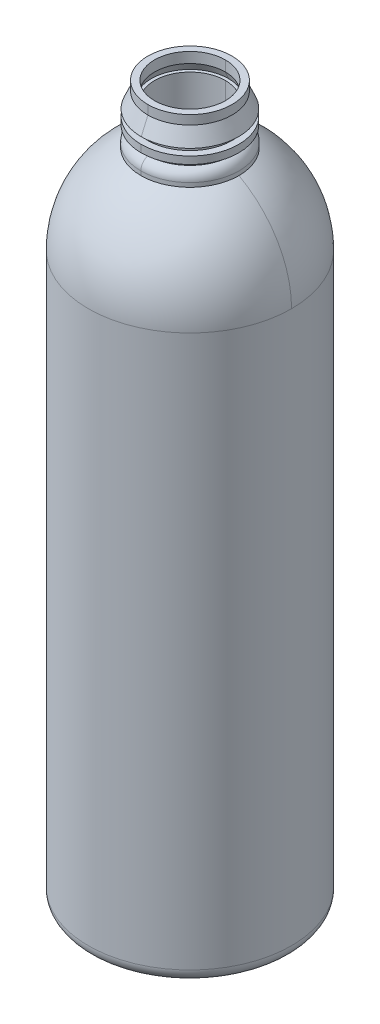
ISO-10303-21;
HEADER;
FILE_DESCRIPTION(('STEP AP214'),'2;1');
FILE_NAME('part.step','',(''),(''),'','','');
FILE_SCHEMA(('AUTOMOTIVE_DESIGN { 1 0 10303 214 1 1 1 1 }'));
ENDSEC;
DATA;
#1=APPLICATION_CONTEXT('core data for automotive mechanical design processes');
#2=APPLICATION_PROTOCOL_DEFINITION('international standard','automotive_design',2000,#1);
#3=PRODUCT_CONTEXT('',#1,'mechanical');
#4=PRODUCT('Part','Part','',(#3));
#5=PRODUCT_RELATED_PRODUCT_CATEGORY('part','',(#4));
#6=PRODUCT_DEFINITION_FORMATION('','',#4);
#7=PRODUCT_DEFINITION_CONTEXT('part definition',#1,'design');
#8=PRODUCT_DEFINITION('design','',#6,#7);
#9=PRODUCT_DEFINITION_SHAPE('','',#8);
#10=(LENGTH_UNIT() NAMED_UNIT(*) SI_UNIT(.MILLI.,.METRE.));
#11=(NAMED_UNIT(*) PLANE_ANGLE_UNIT() SI_UNIT($,.RADIAN.));
#12=(NAMED_UNIT(*) SI_UNIT($,.STERADIAN.) SOLID_ANGLE_UNIT());
#13=UNCERTAINTY_MEASURE_WITH_UNIT(LENGTH_MEASURE(1.E-05),#10,'distance_accuracy_value','');
#14=(GEOMETRIC_REPRESENTATION_CONTEXT(3) GLOBAL_UNCERTAINTY_ASSIGNED_CONTEXT((#13)) GLOBAL_UNIT_ASSIGNED_CONTEXT((#10,
#11,#12)) REPRESENTATION_CONTEXT('',''));
#15=CARTESIAN_POINT('',(0.,0.,0.));
#16=DIRECTION('',(0.,0.,1.));
#17=DIRECTION('',(1.,0.,0.));
#18=AXIS2_PLACEMENT_3D('',#15,#16,#17);
#19=CARTESIAN_POINT('',(0.,99.5234291293078,0.));
#20=DIRECTION('',(0.,1.,0.));
#21=DIRECTION('',(0.,0.,1.));
#22=AXIS2_PLACEMENT_3D('',#19,#20,#21);
#23=CYLINDRICAL_SURFACE('',#22,27.1);
#24=CARTESIAN_POINT('',(0.,-70.5483925549915,0.));
#25=DIRECTION('',(0.,-1.,0.));
#26=DIRECTION('',(0.,0.,-1.));
#27=AXIS2_PLACEMENT_3D('',#24,#25,#26);
#28=CIRCLE('',#27,27.1);
#29=CARTESIAN_POINT('',(0.,-70.5483925549915,-27.1));
#30=VERTEX_POINT('',#29);
#31=CARTESIAN_POINT('',(0.,-70.5483925549915,27.1));
#32=VERTEX_POINT('',#31);
#33=EDGE_CURVE('E281',#30,#32,#28,.F.);
#34=ORIENTED_EDGE('',*,*,#33,.F.);
#35=DIRECTION('',(0.,1.,0.));
#36=VECTOR('',#35,1.);
#37=CARTESIAN_POINT('',(0.,99.5234291293078,-27.1));
#38=LINE('',#37,#36);
#39=CARTESIAN_POINT('',(0.,64.,-27.1));
#40=VERTEX_POINT('',#39);
#41=EDGE_CURVE('E267',#30,#40,#38,.T.);
#42=ORIENTED_EDGE('',*,*,#41,.T.);
#43=CARTESIAN_POINT('',(0.,64.,0.));
#44=DIRECTION('',(0.,1.,0.));
#45=DIRECTION('',(0.,0.,1.));
#46=AXIS2_PLACEMENT_3D('',#43,#44,#45);
#47=CIRCLE('',#46,27.1);
#48=CARTESIAN_POINT('',(-27.1,64.,0.));
#49=VERTEX_POINT('',#48);
#50=EDGE_CURVE('E278',#40,#49,#47,.T.);
#51=ORIENTED_EDGE('',*,*,#50,.T.);
#52=CARTESIAN_POINT('',(0.,64.,0.));
#53=DIRECTION('',(0.,1.,0.));
#54=DIRECTION('',(0.,0.,1.));
#55=AXIS2_PLACEMENT_3D('',#52,#53,#54);
#56=CIRCLE('',#55,27.1);
#57=CARTESIAN_POINT('',(0.,64.,27.1));
#58=VERTEX_POINT('',#57);
#59=EDGE_CURVE('E383',#49,#58,#56,.T.);
#60=ORIENTED_EDGE('',*,*,#59,.T.);
#61=DIRECTION('',(0.,1.,0.));
#62=VECTOR('',#61,1.);
#63=CARTESIAN_POINT('',(0.,99.5234291293078,27.1));
#64=LINE('',#63,#62);
#65=EDGE_CURVE('E283',#32,#58,#64,.T.);
#66=ORIENTED_EDGE('',*,*,#65,.F.);
#67=EDGE_LOOP('',(#34,#42,#51,#60,#66));
#68=FACE_BOUND('',#67,.T.);
#69=ADVANCED_FACE('F40',(#68),#23,.F.);
#70=CARTESIAN_POINT('',(0.,99.5234291293078,0.));
#71=DIRECTION('',(0.,1.,0.));
#72=DIRECTION('',(0.,0.,1.));
#73=AXIS2_PLACEMENT_3D('',#70,#71,#72);
#74=CYLINDRICAL_SURFACE('',#73,27.1);
#75=CARTESIAN_POINT('',(0.,-70.5483925549915,0.));
#76=DIRECTION('',(0.,-1.,0.));
#77=DIRECTION('',(0.,0.,-1.));
#78=AXIS2_PLACEMENT_3D('',#75,#76,#77);
#79=CIRCLE('',#78,27.1);
#80=EDGE_CURVE('E271',#32,#30,#79,.F.);
#81=ORIENTED_EDGE('',*,*,#80,.F.);
#82=ORIENTED_EDGE('',*,*,#65,.T.);
#83=CARTESIAN_POINT('',(0.,64.,0.));
#84=DIRECTION('',(0.,1.,0.));
#85=DIRECTION('',(0.,0.,1.));
#86=AXIS2_PLACEMENT_3D('',#83,#84,#85);
#87=CIRCLE('',#86,27.1);
#88=CARTESIAN_POINT('',(27.1,64.,0.));
#89=VERTEX_POINT('',#88);
#90=EDGE_CURVE('E316',#58,#89,#87,.T.);
#91=ORIENTED_EDGE('',*,*,#90,.T.);
#92=CARTESIAN_POINT('',(0.,64.,0.));
#93=DIRECTION('',(0.,1.,0.));
#94=DIRECTION('',(0.,0.,1.));
#95=AXIS2_PLACEMENT_3D('',#92,#93,#94);
#96=CIRCLE('',#95,27.1);
#97=EDGE_CURVE('E274',#89,#40,#96,.T.);
#98=ORIENTED_EDGE('',*,*,#97,.T.);
#99=ORIENTED_EDGE('',*,*,#41,.F.);
#100=EDGE_LOOP('',(#81,#82,#91,#98,#99));
#101=FACE_BOUND('',#100,.T.);
#102=ADVANCED_FACE('F269',(#101),#74,.F.);
#103=CARTESIAN_POINT('',(0.,64.,0.));
#104=DIRECTION('',(0.,0.,1.));
#105=DIRECTION('',(-1.,0.,0.));
#106=AXIS2_PLACEMENT_3D('',#103,#104,#105);
#107=SPHERICAL_SURFACE('',#106,27.1);
#108=ORIENTED_EDGE('',*,*,#97,.F.);
#109=CARTESIAN_POINT('',(0.,64.,0.));
#110=DIRECTION('',(0.,0.,1.));
#111=DIRECTION('',(1.,0.,0.));
#112=AXIS2_PLACEMENT_3D('',#109,#110,#111);
#113=CIRCLE('',#112,27.1);
#114=CARTESIAN_POINT('',(12.1,88.2487113059643,0.));
#115=VERTEX_POINT('',#114);
#116=EDGE_CURVE('E433',#89,#115,#113,.T.);
#117=ORIENTED_EDGE('',*,*,#116,.T.);
#118=CARTESIAN_POINT('',(0.,88.2487113059643,0.));
#119=DIRECTION('',(0.,1.,0.));
#120=DIRECTION('',(0.,0.,-1.));
#121=AXIS2_PLACEMENT_3D('',#118,#119,#120);
#122=CIRCLE('',#121,12.1);
#123=CARTESIAN_POINT('',(0.,88.2487113059643,-12.1));
#124=VERTEX_POINT('',#123);
#125=EDGE_CURVE('E313',#115,#124,#122,.T.);
#126=ORIENTED_EDGE('',*,*,#125,.T.);
#127=CARTESIAN_POINT('',(0.,88.2487113059643,0.));
#128=DIRECTION('',(0.,1.,0.));
#129=DIRECTION('',(0.,0.,-1.));
#130=AXIS2_PLACEMENT_3D('',#127,#128,#129);
#131=CIRCLE('',#130,12.1);
#132=CARTESIAN_POINT('',(-12.1,88.2487113059643,0.));
#133=VERTEX_POINT('',#132);
#134=EDGE_CURVE('E309',#124,#133,#131,.T.);
#135=ORIENTED_EDGE('',*,*,#134,.T.);
#136=CARTESIAN_POINT('',(0.,64.,0.));
#137=DIRECTION('',(0.,0.,-1.));
#138=DIRECTION('',(-1.,0.,0.));
#139=AXIS2_PLACEMENT_3D('',#136,#137,#138);
#140=CIRCLE('',#139,27.1);
#141=EDGE_CURVE('E356',#49,#133,#140,.T.);
#142=ORIENTED_EDGE('',*,*,#141,.F.);
#143=ORIENTED_EDGE('',*,*,#50,.F.);
#144=EDGE_LOOP('',(#108,#117,#126,#135,#142,#143));
#145=FACE_BOUND('',#144,.T.);
#146=ADVANCED_FACE('F605',(#145),#107,.F.);
#147=CARTESIAN_POINT('',(0.,99.5234291293078,0.));
#148=DIRECTION('',(0.,1.,0.));
#149=DIRECTION('',(0.,0.,1.));
#150=AXIS2_PLACEMENT_3D('',#147,#148,#149);
#151=CYLINDRICAL_SURFACE('',#150,12.1);
#152=ORIENTED_EDGE('',*,*,#134,.F.);
#153=DIRECTION('',(0.,1.,0.));
#154=VECTOR('',#153,1.);
#155=CARTESIAN_POINT('',(0.,99.5234291293078,-12.1));
#156=LINE('',#155,#154);
#157=CARTESIAN_POINT('',(0.,90.5552973247957,-12.1));
#158=VERTEX_POINT('',#157);
#159=EDGE_CURVE('E307',#124,#158,#156,.T.);
#160=ORIENTED_EDGE('',*,*,#159,.T.);
#161=CARTESIAN_POINT('',(0.,90.5552973247957,0.));
#162=DIRECTION('',(0.,1.,0.));
#163=DIRECTION('',(0.,0.,1.));
#164=AXIS2_PLACEMENT_3D('',#161,#162,#163);
#165=CIRCLE('',#164,12.1);
#166=CARTESIAN_POINT('',(0.,90.5552973247957,12.1));
#167=VERTEX_POINT('',#166);
#168=EDGE_CURVE('E303',#158,#167,#165,.T.);
#169=ORIENTED_EDGE('',*,*,#168,.T.);
#170=DIRECTION('',(0.,1.,0.));
#171=VECTOR('',#170,1.);
#172=CARTESIAN_POINT('',(0.,99.5234291293078,12.1));
#173=LINE('',#172,#171);
#174=CARTESIAN_POINT('',(0.,88.2487113059643,12.1));
#175=VERTEX_POINT('',#174);
#176=EDGE_CURVE('E367',#175,#167,#173,.T.);
#177=ORIENTED_EDGE('',*,*,#176,.F.);
#178=CARTESIAN_POINT('',(0.,88.2487113059643,0.));
#179=DIRECTION('',(0.,1.,0.));
#180=DIRECTION('',(0.,0.,-1.));
#181=AXIS2_PLACEMENT_3D('',#178,#179,#180);
#182=CIRCLE('',#181,12.1);
#183=EDGE_CURVE('E360',#133,#175,#182,.T.);
#184=ORIENTED_EDGE('',*,*,#183,.F.);
#185=EDGE_LOOP('',(#152,#160,#169,#177,#184));
#186=FACE_BOUND('',#185,.T.);
#187=ADVANCED_FACE('F611',(#186),#151,.F.);
#188=CARTESIAN_POINT('',(0.,90.5552973247957,0.));
#189=DIRECTION('',(0.,1.,0.));
#190=DIRECTION('',(0.,0.,1.));
#191=AXIS2_PLACEMENT_3D('',#188,#189,#190);
#192=TOROIDAL_SURFACE('',#191,11.,1.1);
#193=ORIENTED_EDGE('',*,*,#168,.F.);
#194=CARTESIAN_POINT('',(0.,90.5552973247957,-11.));
#195=DIRECTION('',(1.,0.,0.));
#196=DIRECTION('',(0.,0.,-1.));
#197=AXIS2_PLACEMENT_3D('',#194,#195,#196);
#198=CIRCLE('',#197,1.1);
#199=CARTESIAN_POINT('',(0.,91.1877528568293,-10.1));
#200=VERTEX_POINT('',#199);
#201=EDGE_CURVE('E308',#158,#200,#198,.T.);
#202=ORIENTED_EDGE('',*,*,#201,.T.);
#203=CARTESIAN_POINT('',(0.,91.1877528568293,0.));
#204=DIRECTION('',(0.,1.,0.));
#205=DIRECTION('',(0.,0.,-1.));
#206=AXIS2_PLACEMENT_3D('',#203,#204,#205);
#207=CIRCLE('',#206,10.1);
#208=CARTESIAN_POINT('',(0.,91.1877528568293,10.1));
#209=VERTEX_POINT('',#208);
#210=EDGE_CURVE('E377',#200,#209,#207,.T.);
#211=ORIENTED_EDGE('',*,*,#210,.T.);
#212=CARTESIAN_POINT('',(0.,90.5552973247957,11.));
#213=DIRECTION('',(-1.,0.,0.));
#214=DIRECTION('',(0.,0.,1.));
#215=AXIS2_PLACEMENT_3D('',#212,#213,#214);
#216=CIRCLE('',#215,1.1);
#217=EDGE_CURVE('E426',#167,#209,#216,.T.);
#218=ORIENTED_EDGE('',*,*,#217,.F.);
#219=EDGE_LOOP('',(#193,#202,#211,#218));
#220=FACE_BOUND('',#219,.T.);
#221=ADVANCED_FACE('F630',(#220),#192,.F.);
#222=CARTESIAN_POINT('',(0.,99.5234291293078,0.));
#223=DIRECTION('',(0.,1.,0.));
#224=DIRECTION('',(0.,0.,1.));
#225=AXIS2_PLACEMENT_3D('',#222,#223,#224);
#226=CYLINDRICAL_SURFACE('',#225,10.1);
#227=ORIENTED_EDGE('',*,*,#210,.F.);
#228=DIRECTION('',(0.,1.,0.));
#229=VECTOR('',#228,1.);
#230=CARTESIAN_POINT('',(0.,99.5234291293078,-10.1));
#231=LINE('',#230,#229);
#232=CARTESIAN_POINT('',(0.,100.856305269671,-10.1));
#233=VERTEX_POINT('',#232);
#234=EDGE_CURVE('E412',#200,#233,#231,.T.);
#235=ORIENTED_EDGE('',*,*,#234,.T.);
#236=CARTESIAN_POINT('',(0.,100.856305269671,0.));
#237=DIRECTION('',(0.,1.,0.));
#238=DIRECTION('',(0.,0.,1.));
#239=AXIS2_PLACEMENT_3D('',#236,#237,#238);
#240=CIRCLE('',#239,10.1);
#241=CARTESIAN_POINT('',(0.,100.856305269671,10.1));
#242=VERTEX_POINT('',#241);
#243=EDGE_CURVE('E416',#233,#242,#240,.T.);
#244=ORIENTED_EDGE('',*,*,#243,.T.);
#245=DIRECTION('',(0.,1.,0.));
#246=VECTOR('',#245,1.);
#247=CARTESIAN_POINT('',(0.,99.5234291293078,10.1));
#248=LINE('',#247,#246);
#249=EDGE_CURVE('E425',#209,#242,#248,.T.);
#250=ORIENTED_EDGE('',*,*,#249,.F.);
#251=EDGE_LOOP('',(#227,#235,#244,#250));
#252=FACE_BOUND('',#251,.T.);
#253=ADVANCED_FACE('F650',(#252),#226,.F.);
#254=CARTESIAN_POINT('',(0.,98.2030768387021,0.));
#255=DIRECTION('',(0.,-1.,0.));
#256=DIRECTION('',(0.,0.,-1.));
#257=AXIS2_PLACEMENT_3D('',#254,#255,#256);
#258=CONICAL_SURFACE('',#257,12.1556815282812,0.407631505457626);
#259=CARTESIAN_POINT('',(0.,102.963602483143,0.));
#260=DIRECTION('',(0.,1.,0.));
#261=DIRECTION('',(0.,0.,-1.));
#262=AXIS2_PLACEMENT_3D('',#259,#260,#261);
#263=CIRCLE('',#262,10.1);
#264=CARTESIAN_POINT('',(0.,102.963602483143,-10.1));
#265=VERTEX_POINT('',#264);
#266=CARTESIAN_POINT('',(0.,102.963602483143,10.1));
#267=VERTEX_POINT('',#266);
#268=EDGE_CURVE('E420',#265,#267,#263,.T.);
#269=ORIENTED_EDGE('',*,*,#268,.T.);
#270=DIRECTION('',(0.,-0.918062353536191,0.396436016299717));
#271=VECTOR('',#270,1.);
#272=CARTESIAN_POINT('',(0.,98.2030768387021,12.1556815282812));
#273=LINE('',#272,#271);
#274=CARTESIAN_POINT('',(0.,100.856305269671,11.0099692512717));
#275=VERTEX_POINT('',#274);
#276=EDGE_CURVE('E337',#267,#275,#273,.T.);
#277=ORIENTED_EDGE('',*,*,#276,.T.);
#278=CARTESIAN_POINT('',(0.,100.856305269671,0.));
#279=DIRECTION('',(0.,1.,0.));
#280=DIRECTION('',(0.,0.,1.));
#281=AXIS2_PLACEMENT_3D('',#278,#279,#280);
#282=CIRCLE('',#281,11.0099692512717);
#283=CARTESIAN_POINT('',(0.,100.856305269671,-11.0099692512717));
#284=VERTEX_POINT('',#283);
#285=EDGE_CURVE('E387',#284,#275,#282,.T.);
#286=ORIENTED_EDGE('',*,*,#285,.F.);
#287=DIRECTION('',(0.,-0.918062353536191,-0.396436016299717));
#288=VECTOR('',#287,1.);
#289=CARTESIAN_POINT('',(0.,98.2030768387021,-12.1556815282812));
#290=LINE('',#289,#288);
#291=EDGE_CURVE('E390',#265,#284,#290,.T.);
#292=ORIENTED_EDGE('',*,*,#291,.F.);
#293=EDGE_LOOP('',(#269,#277,#286,#292));
#294=FACE_BOUND('',#293,.T.);
#295=ADVANCED_FACE('F617',(#294),#258,.F.);
#296=CARTESIAN_POINT('',(0.,99.5234291293078,0.));
#297=DIRECTION('',(0.,1.,0.));
#298=DIRECTION('',(0.,0.,1.));
#299=AXIS2_PLACEMENT_3D('',#296,#297,#298);
#300=CYLINDRICAL_SURFACE('',#299,10.1);
#301=ORIENTED_EDGE('',*,*,#268,.F.);
#302=DIRECTION('',(0.,1.,0.));
#303=VECTOR('',#302,1.);
#304=CARTESIAN_POINT('',(0.,99.5234291293078,-10.1));
#305=LINE('',#304,#303);
#306=CARTESIAN_POINT('',(0.,105.956305269671,-10.1));
#307=VERTEX_POINT('',#306);
#308=EDGE_CURVE('E333',#265,#307,#305,.T.);
#309=ORIENTED_EDGE('',*,*,#308,.T.);
#310=CARTESIAN_POINT('',(0.,105.956305269671,0.));
#311=DIRECTION('',(0.,1.,0.));
#312=DIRECTION('',(0.,0.,-1.));
#313=AXIS2_PLACEMENT_3D('',#310,#311,#312);
#314=CIRCLE('',#313,10.1);
#315=CARTESIAN_POINT('',(0.,105.956305269671,10.1));
#316=VERTEX_POINT('',#315);
#317=EDGE_CURVE('E338',#307,#316,#314,.T.);
#318=ORIENTED_EDGE('',*,*,#317,.T.);
#319=DIRECTION('',(0.,1.,0.));
#320=VECTOR('',#319,1.);
#321=CARTESIAN_POINT('',(0.,99.5234291293078,10.1));
#322=LINE('',#321,#320);
#323=EDGE_CURVE('E444',#267,#316,#322,.T.);
#324=ORIENTED_EDGE('',*,*,#323,.F.);
#325=EDGE_LOOP('',(#301,#309,#318,#324));
#326=FACE_BOUND('',#325,.T.);
#327=ADVANCED_FACE('F613',(#326),#300,.F.);
#328=CARTESIAN_POINT('',(0.,99.5234291293078,0.));
#329=DIRECTION('',(0.,1.,0.));
#330=DIRECTION('',(0.,0.,1.));
#331=AXIS2_PLACEMENT_3D('',#328,#329,#330);
#332=CYLINDRICAL_SURFACE('',#331,29.);
#333=CARTESIAN_POINT('',(0.,-93.4083925549915,0.));
#334=DIRECTION('',(0.,-1.,0.));
#335=DIRECTION('',(0.,0.,-1.));
#336=AXIS2_PLACEMENT_3D('',#333,#334,#335);
#337=CIRCLE('',#336,29.);
#338=CARTESIAN_POINT('',(0.,-93.4083925549915,-29.));
#339=VERTEX_POINT('',#338);
#340=EDGE_CURVE('E11',#339,#339,#337,.F.);
#341=ORIENTED_EDGE('',*,*,#340,.T.);
#342=EDGE_LOOP('',(#341));
#343=FACE_BOUND('',#342,.T.);
#344=DIRECTION('',(0.,1.,0.));
#345=VECTOR('',#344,1.);
#346=CARTESIAN_POINT('',(0.,99.5234291293078,29.));
#347=LINE('',#346,#345);
#348=CARTESIAN_POINT('',(0.,-70.5483925549915,29.));
#349=VERTEX_POINT('',#348);
#350=CARTESIAN_POINT('',(0.,64.,29.));
#351=VERTEX_POINT('',#350);
#352=EDGE_CURVE('E54',#349,#351,#347,.T.);
#353=ORIENTED_EDGE('',*,*,#352,.F.);
#354=ORIENTED_EDGE('',*,*,#352,.T.);
#355=CARTESIAN_POINT('',(0.,64.,0.));
#356=DIRECTION('',(0.,1.,0.));
#357=DIRECTION('',(0.,0.,1.));
#358=AXIS2_PLACEMENT_3D('',#355,#356,#357);
#359=CIRCLE('',#358,29.);
#360=CARTESIAN_POINT('',(-29.,64.,0.));
#361=VERTEX_POINT('',#360);
#362=EDGE_CURVE('E373',#361,#351,#359,.T.);
#363=ORIENTED_EDGE('',*,*,#362,.F.);
#364=CARTESIAN_POINT('',(0.,64.,0.));
#365=DIRECTION('',(0.,1.,0.));
#366=DIRECTION('',(0.,0.,1.));
#367=AXIS2_PLACEMENT_3D('',#364,#365,#366);
#368=CIRCLE('',#367,29.);
#369=CARTESIAN_POINT('',(0.,64.,-29.));
#370=VERTEX_POINT('',#369);
#371=EDGE_CURVE('E470',#370,#361,#368,.T.);
#372=ORIENTED_EDGE('',*,*,#371,.F.);
#373=DIRECTION('',(0.,1.,0.));
#374=VECTOR('',#373,1.);
#375=CARTESIAN_POINT('',(0.,99.5234291293078,-29.));
#376=LINE('',#375,#374);
#377=CARTESIAN_POINT('',(0.,-70.5483925549915,-29.));
#378=VERTEX_POINT('',#377);
#379=EDGE_CURVE('E59',#378,#370,#376,.T.);
#380=ORIENTED_EDGE('',*,*,#379,.F.);
#381=ORIENTED_EDGE('',*,*,#379,.T.);
#382=CARTESIAN_POINT('',(0.,64.,0.));
#383=DIRECTION('',(0.,1.,0.));
#384=DIRECTION('',(0.,0.,1.));
#385=AXIS2_PLACEMENT_3D('',#382,#383,#384);
#386=CIRCLE('',#385,29.);
#387=CARTESIAN_POINT('',(29.,64.,0.));
#388=VERTEX_POINT('',#387);
#389=EDGE_CURVE('E441',#388,#370,#386,.T.);
#390=ORIENTED_EDGE('',*,*,#389,.F.);
#391=CARTESIAN_POINT('',(0.,64.,0.));
#392=DIRECTION('',(0.,1.,0.));
#393=DIRECTION('',(0.,0.,1.));
#394=AXIS2_PLACEMENT_3D('',#391,#392,#393);
#395=CIRCLE('',#394,29.);
#396=EDGE_CURVE('E405',#351,#388,#395,.T.);
#397=ORIENTED_EDGE('',*,*,#396,.F.);
#398=EDGE_LOOP('',(#353,#354,#363,#372,#380,#381,#390,#397));
#399=FACE_BOUND('',#398,.T.);
#400=ADVANCED_FACE('F616',(#343,#399),#332,.T.);
#401=CARTESIAN_POINT('',(0.,64.,0.));
#402=DIRECTION('',(0.,0.,1.));
#403=DIRECTION('',(-1.,0.,0.));
#404=AXIS2_PLACEMENT_3D('',#401,#402,#403);
#405=SPHERICAL_SURFACE('',#404,29.);
#406=ORIENTED_EDGE('',*,*,#362,.T.);
#407=ORIENTED_EDGE('',*,*,#396,.T.);
#408=CARTESIAN_POINT('',(0.,64.,0.));
#409=DIRECTION('',(0.,0.,1.));
#410=DIRECTION('',(1.,0.,0.));
#411=AXIS2_PLACEMENT_3D('',#408,#409,#410);
#412=CIRCLE('',#411,29.);
#413=CARTESIAN_POINT('',(14.,89.3968501984006,0.));
#414=VERTEX_POINT('',#413);
#415=EDGE_CURVE('E401',#388,#414,#412,.T.);
#416=ORIENTED_EDGE('',*,*,#415,.T.);
#417=CARTESIAN_POINT('',(0.,89.3968501984006,0.));
#418=DIRECTION('',(0.,1.,0.));
#419=DIRECTION('',(0.,0.,1.));
#420=AXIS2_PLACEMENT_3D('',#417,#418,#419);
#421=CIRCLE('',#420,14.);
#422=CARTESIAN_POINT('',(0.,89.3968501984006,14.));
#423=VERTEX_POINT('',#422);
#424=EDGE_CURVE('E327',#423,#414,#421,.T.);
#425=ORIENTED_EDGE('',*,*,#424,.F.);
#426=CARTESIAN_POINT('',(0.,89.3968501984006,0.));
#427=DIRECTION('',(0.,1.,0.));
#428=DIRECTION('',(0.,0.,1.));
#429=AXIS2_PLACEMENT_3D('',#426,#427,#428);
#430=CIRCLE('',#429,14.);
#431=CARTESIAN_POINT('',(-14.,89.3968501984006,0.));
#432=VERTEX_POINT('',#431);
#433=EDGE_CURVE('E440',#432,#423,#430,.T.);
#434=ORIENTED_EDGE('',*,*,#433,.F.);
#435=CARTESIAN_POINT('',(0.,64.,0.));
#436=DIRECTION('',(0.,0.,-1.));
#437=DIRECTION('',(-1.,0.,0.));
#438=AXIS2_PLACEMENT_3D('',#435,#436,#437);
#439=CIRCLE('',#438,29.);
#440=EDGE_CURVE('E490',#361,#432,#439,.T.);
#441=ORIENTED_EDGE('',*,*,#440,.F.);
#442=EDGE_LOOP('',(#406,#407,#416,#425,#434,#441));
#443=FACE_BOUND('',#442,.T.);
#444=ADVANCED_FACE('F621',(#443),#405,.T.);
#445=CARTESIAN_POINT('',(0.,99.5234291293078,0.));
#446=DIRECTION('',(0.,1.,0.));
#447=DIRECTION('',(0.,0.,1.));
#448=AXIS2_PLACEMENT_3D('',#445,#446,#447);
#449=CYLINDRICAL_SURFACE('',#448,14.);
#450=ORIENTED_EDGE('',*,*,#424,.T.);
#451=CARTESIAN_POINT('',(0.,89.3968501984006,0.));
#452=DIRECTION('',(0.,1.,0.));
#453=DIRECTION('',(0.,0.,1.));
#454=AXIS2_PLACEMENT_3D('',#451,#452,#453);
#455=CIRCLE('',#454,14.);
#456=CARTESIAN_POINT('',(0.,89.3968501984006,-14.));
#457=VERTEX_POINT('',#456);
#458=EDGE_CURVE('E323',#414,#457,#455,.T.);
#459=ORIENTED_EDGE('',*,*,#458,.T.);
#460=DIRECTION('',(0.,1.,0.));
#461=VECTOR('',#460,1.);
#462=CARTESIAN_POINT('',(0.,99.5234291293078,-14.));
#463=LINE('',#462,#461);
#464=CARTESIAN_POINT('',(0.,90.5552973247956,-14.));
#465=VERTEX_POINT('',#464);
#466=EDGE_CURVE('E321',#457,#465,#463,.T.);
#467=ORIENTED_EDGE('',*,*,#466,.T.);
#468=CARTESIAN_POINT('',(0.,90.5552973247956,0.));
#469=DIRECTION('',(0.,1.,0.));
#470=DIRECTION('',(0.,0.,1.));
#471=AXIS2_PLACEMENT_3D('',#468,#469,#470);
#472=CIRCLE('',#471,14.);
#473=CARTESIAN_POINT('',(0.,90.5552973247956,14.));
#474=VERTEX_POINT('',#473);
#475=EDGE_CURVE('E317',#474,#465,#472,.T.);
#476=ORIENTED_EDGE('',*,*,#475,.F.);
#477=DIRECTION('',(0.,1.,0.));
#478=VECTOR('',#477,1.);
#479=CARTESIAN_POINT('',(0.,99.5234291293078,14.));
#480=LINE('',#479,#478);
#481=EDGE_CURVE('E437',#423,#474,#480,.T.);
#482=ORIENTED_EDGE('',*,*,#481,.F.);
#483=EDGE_LOOP('',(#450,#459,#467,#476,#482));
#484=FACE_BOUND('',#483,.T.);
#485=ADVANCED_FACE('F638',(#484),#449,.T.);
#486=CARTESIAN_POINT('',(0.,90.5552973247957,0.));
#487=DIRECTION('',(0.,1.,0.));
#488=DIRECTION('',(0.,0.,1.));
#489=AXIS2_PLACEMENT_3D('',#486,#487,#488);
#490=TOROIDAL_SURFACE('',#489,11.,3.);
#491=ORIENTED_EDGE('',*,*,#475,.T.);
#492=CARTESIAN_POINT('',(0.,90.5552973247957,-11.));
#493=DIRECTION('',(1.,0.,0.));
#494=DIRECTION('',(0.,0.,-1.));
#495=AXIS2_PLACEMENT_3D('',#492,#493,#494);
#496=CIRCLE('',#495,3.);
#497=CARTESIAN_POINT('',(0.,93.3837244495418,-12.));
#498=VERTEX_POINT('',#497);
#499=EDGE_CURVE('E322',#465,#498,#496,.T.);
#500=ORIENTED_EDGE('',*,*,#499,.T.);
#501=CARTESIAN_POINT('',(0.,93.3837244495418,0.));
#502=DIRECTION('',(0.,1.,0.));
#503=DIRECTION('',(0.,0.,1.));
#504=AXIS2_PLACEMENT_3D('',#501,#502,#503);
#505=CIRCLE('',#504,12.);
#506=CARTESIAN_POINT('',(0.,93.3837244495418,12.));
#507=VERTEX_POINT('',#506);
#508=EDGE_CURVE('E400',#507,#498,#505,.T.);
#509=ORIENTED_EDGE('',*,*,#508,.F.);
#510=CARTESIAN_POINT('',(0.,90.5552973247957,11.));
#511=DIRECTION('',(-1.,0.,0.));
#512=DIRECTION('',(0.,0.,1.));
#513=AXIS2_PLACEMENT_3D('',#510,#511,#512);
#514=CIRCLE('',#513,3.);
#515=EDGE_CURVE('E458',#474,#507,#514,.T.);
#516=ORIENTED_EDGE('',*,*,#515,.F.);
#517=EDGE_LOOP('',(#491,#500,#509,#516));
#518=FACE_BOUND('',#517,.T.);
#519=ADVANCED_FACE('F641',(#518),#490,.T.);
#520=CARTESIAN_POINT('',(0.,99.5234291293078,0.));
#521=DIRECTION('',(0.,1.,0.));
#522=DIRECTION('',(0.,0.,1.));
#523=AXIS2_PLACEMENT_3D('',#520,#521,#522);
#524=CYLINDRICAL_SURFACE('',#523,12.);
#525=ORIENTED_EDGE('',*,*,#508,.T.);
#526=DIRECTION('',(0.,1.,0.));
#527=VECTOR('',#526,1.);
#528=CARTESIAN_POINT('',(0.,99.5234291293078,-12.));
#529=LINE('',#528,#527);
#530=CARTESIAN_POINT('',(0.,94.9563052696716,-12.));
#531=VERTEX_POINT('',#530);
#532=EDGE_CURVE('E354',#498,#531,#529,.T.);
#533=ORIENTED_EDGE('',*,*,#532,.T.);
#534=CARTESIAN_POINT('',(0.,94.9563052696716,0.));
#535=DIRECTION('',(0.,1.,0.));
#536=DIRECTION('',(0.,0.,1.));
#537=AXIS2_PLACEMENT_3D('',#534,#535,#536);
#538=CIRCLE('',#537,12.);
#539=CARTESIAN_POINT('',(0.,94.9563052696716,12.));
#540=VERTEX_POINT('',#539);
#541=EDGE_CURVE('E328',#540,#531,#538,.T.);
#542=ORIENTED_EDGE('',*,*,#541,.F.);
#543=DIRECTION('',(0.,1.,0.));
#544=VECTOR('',#543,1.);
#545=CARTESIAN_POINT('',(0.,99.5234291293078,12.));
#546=LINE('',#545,#544);
#547=EDGE_CURVE('E343',#507,#540,#546,.T.);
#548=ORIENTED_EDGE('',*,*,#547,.F.);
#549=EDGE_LOOP('',(#525,#533,#542,#548));
#550=FACE_BOUND('',#549,.T.);
#551=ADVANCED_FACE('F689',(#550),#524,.T.);
#552=CARTESIAN_POINT('',(0.,99.5234291293078,0.));
#553=DIRECTION('',(0.,1.,0.));
#554=DIRECTION('',(0.,0.,1.));
#555=AXIS2_PLACEMENT_3D('',#552,#553,#554);
#556=CYLINDRICAL_SURFACE('',#555,13.9);
#557=CARTESIAN_POINT('',(0.,94.9563052696716,0.));
#558=DIRECTION('',(0.,1.,0.));
#559=DIRECTION('',(0.,0.,1.));
#560=AXIS2_PLACEMENT_3D('',#557,#558,#559);
#561=CIRCLE('',#560,13.9);
#562=CARTESIAN_POINT('',(0.,94.9563052696716,13.9));
#563=VERTEX_POINT('',#562);
#564=CARTESIAN_POINT('',(0.,94.9563052696716,-13.9));
#565=VERTEX_POINT('',#564);
#566=EDGE_CURVE('E350',#563,#565,#561,.T.);
#567=ORIENTED_EDGE('',*,*,#566,.T.);
#568=DIRECTION('',(0.,1.,0.));
#569=VECTOR('',#568,1.);
#570=CARTESIAN_POINT('',(0.,99.5234291293078,-13.9));
#571=LINE('',#570,#569);
#572=CARTESIAN_POINT('',(0.,97.0563052696715,-13.9));
#573=VERTEX_POINT('',#572);
#574=EDGE_CURVE('E355',#565,#573,#571,.T.);
#575=ORIENTED_EDGE('',*,*,#574,.T.);
#576=CARTESIAN_POINT('',(0.,97.0563052696715,0.));
#577=DIRECTION('',(0.,1.,0.));
#578=DIRECTION('',(0.,0.,1.));
#579=AXIS2_PLACEMENT_3D('',#576,#577,#578);
#580=CIRCLE('',#579,13.9);
#581=CARTESIAN_POINT('',(0.,97.0563052696715,13.9));
#582=VERTEX_POINT('',#581);
#583=EDGE_CURVE('E396',#582,#573,#580,.T.);
#584=ORIENTED_EDGE('',*,*,#583,.F.);
#585=DIRECTION('',(0.,1.,0.));
#586=VECTOR('',#585,1.);
#587=CARTESIAN_POINT('',(0.,99.5234291293078,13.9));
#588=LINE('',#587,#586);
#589=EDGE_CURVE('E331',#563,#582,#588,.T.);
#590=ORIENTED_EDGE('',*,*,#589,.F.);
#591=EDGE_LOOP('',(#567,#575,#584,#590));
#592=FACE_BOUND('',#591,.T.);
#593=ADVANCED_FACE('F708',(#592),#556,.T.);
#594=CARTESIAN_POINT('',(0.,99.5234291293078,0.));
#595=DIRECTION('',(0.,1.,0.));
#596=DIRECTION('',(0.,0.,1.));
#597=AXIS2_PLACEMENT_3D('',#594,#595,#596);
#598=CYLINDRICAL_SURFACE('',#597,12.);
#599=CARTESIAN_POINT('',(0.,97.0563052696715,0.));
#600=DIRECTION('',(0.,1.,0.));
#601=DIRECTION('',(0.,0.,1.));
#602=AXIS2_PLACEMENT_3D('',#599,#600,#601);
#603=CIRCLE('',#602,12.);
#604=CARTESIAN_POINT('',(0.,97.0563052696715,12.));
#605=VERTEX_POINT('',#604);
#606=CARTESIAN_POINT('',(0.,97.0563052696715,-12.));
#607=VERTEX_POINT('',#606);
#608=EDGE_CURVE('E462',#605,#607,#603,.T.);
#609=ORIENTED_EDGE('',*,*,#608,.T.);
#610=DIRECTION('',(0.,1.,0.));
#611=VECTOR('',#610,1.);
#612=CARTESIAN_POINT('',(0.,99.5234291293078,-12.));
#613=LINE('',#612,#611);
#614=CARTESIAN_POINT('',(0.,98.9563052696715,-12.));
#615=VERTEX_POINT('',#614);
#616=EDGE_CURVE('E365',#607,#615,#613,.T.);
#617=ORIENTED_EDGE('',*,*,#616,.T.);
#618=CARTESIAN_POINT('',(0.,98.9563052696715,0.));
#619=DIRECTION('',(0.,1.,0.));
#620=DIRECTION('',(0.,0.,1.));
#621=AXIS2_PLACEMENT_3D('',#618,#619,#620);
#622=CIRCLE('',#621,12.);
#623=CARTESIAN_POINT('',(0.,98.9563052696715,12.));
#624=VERTEX_POINT('',#623);
#625=EDGE_CURVE('E296',#624,#615,#622,.T.);
#626=ORIENTED_EDGE('',*,*,#625,.F.);
#627=DIRECTION('',(0.,1.,0.));
#628=VECTOR('',#627,1.);
#629=CARTESIAN_POINT('',(0.,99.5234291293078,12.));
#630=LINE('',#629,#628);
#631=EDGE_CURVE('E392',#605,#624,#630,.T.);
#632=ORIENTED_EDGE('',*,*,#631,.F.);
#633=EDGE_LOOP('',(#609,#617,#626,#632));
#634=FACE_BOUND('',#633,.T.);
#635=ADVANCED_FACE('F704',(#634),#598,.T.);
#636=CARTESIAN_POINT('',(0.,98.9563052696715,0.));
#637=DIRECTION('',(0.,-1.,0.));
#638=DIRECTION('',(0.,0.,-1.));
#639=AXIS2_PLACEMENT_3D('',#636,#637,#638);
#640=CONICAL_SURFACE('',#639,13.9,0.407631505457626);
#641=CARTESIAN_POINT('',(0.,103.356305269672,0.));
#642=DIRECTION('',(0.,1.,0.));
#643=DIRECTION('',(0.,0.,1.));
#644=AXIS2_PLACEMENT_3D('',#641,#642,#643);
#645=CIRCLE('',#644,12.);
#646=CARTESIAN_POINT('',(0.,103.356305269672,12.));
#647=VERTEX_POINT('',#646);
#648=CARTESIAN_POINT('',(0.,103.356305269672,-12.));
#649=VERTEX_POINT('',#648);
#650=EDGE_CURVE('E450',#647,#649,#645,.T.);
#651=ORIENTED_EDGE('',*,*,#650,.F.);
#652=DIRECTION('',(0.,-0.918062353536191,0.396436016299717));
#653=VECTOR('',#652,1.);
#654=CARTESIAN_POINT('',(0.,98.9563052696715,13.9));
#655=LINE('',#654,#653);
#656=CARTESIAN_POINT('',(0.,98.9563052696715,13.9));
#657=VERTEX_POINT('',#656);
#658=EDGE_CURVE('E361',#647,#657,#655,.T.);
#659=ORIENTED_EDGE('',*,*,#658,.T.);
#660=CARTESIAN_POINT('',(0.,98.9563052696715,0.));
#661=DIRECTION('',(0.,1.,0.));
#662=DIRECTION('',(0.,0.,1.));
#663=AXIS2_PLACEMENT_3D('',#660,#661,#662);
#664=CIRCLE('',#663,13.9);
#665=CARTESIAN_POINT('',(0.,98.9563052696715,-13.9));
#666=VERTEX_POINT('',#665);
#667=EDGE_CURVE('E366',#657,#666,#664,.T.);
#668=ORIENTED_EDGE('',*,*,#667,.T.);
#669=DIRECTION('',(0.,-0.918062353536191,-0.396436016299717));
#670=VECTOR('',#669,1.);
#671=CARTESIAN_POINT('',(0.,98.9563052696715,-13.9));
#672=LINE('',#671,#670);
#673=EDGE_CURVE('E295',#649,#666,#672,.T.);
#674=ORIENTED_EDGE('',*,*,#673,.F.);
#675=EDGE_LOOP('',(#651,#659,#668,#674));
#676=FACE_BOUND('',#675,.T.);
#677=ADVANCED_FACE('F707',(#676),#640,.T.);
#678=CARTESIAN_POINT('',(0.,99.5234291293078,0.));
#679=DIRECTION('',(0.,1.,0.));
#680=DIRECTION('',(0.,0.,1.));
#681=AXIS2_PLACEMENT_3D('',#678,#679,#680);
#682=CYLINDRICAL_SURFACE('',#681,12.);
#683=ORIENTED_EDGE('',*,*,#650,.T.);
#684=DIRECTION('',(0.,1.,0.));
#685=VECTOR('',#684,1.);
#686=CARTESIAN_POINT('',(0.,99.5234291293078,-12.));
#687=LINE('',#686,#685);
#688=CARTESIAN_POINT('',(0.,105.956305269671,-12.));
#689=VERTEX_POINT('',#688);
#690=EDGE_CURVE('E454',#649,#689,#687,.T.);
#691=ORIENTED_EDGE('',*,*,#690,.T.);
#692=CARTESIAN_POINT('',(0.,105.956305269671,0.));
#693=DIRECTION('',(0.,1.,0.));
#694=DIRECTION('',(0.,0.,1.));
#695=AXIS2_PLACEMENT_3D('',#692,#693,#694);
#696=CIRCLE('',#695,12.);
#697=CARTESIAN_POINT('',(0.,105.956305269671,12.));
#698=VERTEX_POINT('',#697);
#699=EDGE_CURVE('E496',#698,#689,#696,.T.);
#700=ORIENTED_EDGE('',*,*,#699,.F.);
#701=DIRECTION('',(0.,1.,0.));
#702=VECTOR('',#701,1.);
#703=CARTESIAN_POINT('',(0.,99.5234291293078,12.));
#704=LINE('',#703,#702);
#705=EDGE_CURVE('E302',#647,#698,#704,.T.);
#706=ORIENTED_EDGE('',*,*,#705,.F.);
#707=EDGE_LOOP('',(#683,#691,#700,#706));
#708=FACE_BOUND('',#707,.T.);
#709=ADVANCED_FACE('F718',(#708),#682,.T.);
#710=CARTESIAN_POINT('',(0.,105.956305269671,0.));
#711=DIRECTION('',(0.,-1.,0.));
#712=DIRECTION('',(0.,0.,-1.));
#713=AXIS2_PLACEMENT_3D('',#710,#711,#712);
#714=PLANE('',#713);
#715=ORIENTED_EDGE('',*,*,#699,.T.);
#716=CARTESIAN_POINT('',(0.,105.956305269671,0.));
#717=DIRECTION('',(0.,1.,0.));
#718=DIRECTION('',(0.,0.,1.));
#719=AXIS2_PLACEMENT_3D('',#716,#717,#718);
#720=CIRCLE('',#719,12.);
#721=EDGE_CURVE('E301',#689,#698,#720,.T.);
#722=ORIENTED_EDGE('',*,*,#721,.T.);
#723=EDGE_LOOP('',(#715,#722));
#724=FACE_BOUND('',#723,.T.);
#725=CARTESIAN_POINT('',(0.,105.956305269671,0.));
#726=DIRECTION('',(0.,1.,0.));
#727=DIRECTION('',(0.,0.,-1.));
#728=AXIS2_PLACEMENT_3D('',#725,#726,#727);
#729=CIRCLE('',#728,10.1);
#730=EDGE_CURVE('E474',#316,#307,#729,.T.);
#731=ORIENTED_EDGE('',*,*,#730,.F.);
#732=ORIENTED_EDGE('',*,*,#317,.F.);
#733=EDGE_LOOP('',(#731,#732));
#734=FACE_BOUND('',#733,.T.);
#735=ADVANCED_FACE('F664',(#724,#734),#714,.F.);
#736=CARTESIAN_POINT('',(0.,99.5234291293078,0.));
#737=DIRECTION('',(0.,1.,0.));
#738=DIRECTION('',(0.,0.,1.));
#739=AXIS2_PLACEMENT_3D('',#736,#737,#738);
#740=CYLINDRICAL_SURFACE('',#739,12.);
#741=ORIENTED_EDGE('',*,*,#690,.F.);
#742=CARTESIAN_POINT('',(0.,103.356305269672,0.));
#743=DIRECTION('',(0.,1.,0.));
#744=DIRECTION('',(0.,0.,1.));
#745=AXIS2_PLACEMENT_3D('',#742,#743,#744);
#746=CIRCLE('',#745,12.);
#747=EDGE_CURVE('E297',#649,#647,#746,.T.);
#748=ORIENTED_EDGE('',*,*,#747,.T.);
#749=ORIENTED_EDGE('',*,*,#705,.T.);
#750=ORIENTED_EDGE('',*,*,#721,.F.);
#751=EDGE_LOOP('',(#741,#748,#749,#750));
#752=FACE_BOUND('',#751,.T.);
#753=ADVANCED_FACE('F661',(#752),#740,.T.);
#754=CARTESIAN_POINT('',(0.,98.9563052696715,0.));
#755=DIRECTION('',(0.,-1.,0.));
#756=DIRECTION('',(0.,0.,-1.));
#757=AXIS2_PLACEMENT_3D('',#754,#755,#756);
#758=CONICAL_SURFACE('',#757,13.9,0.407631505457626);
#759=ORIENTED_EDGE('',*,*,#658,.F.);
#760=ORIENTED_EDGE('',*,*,#747,.F.);
#761=ORIENTED_EDGE('',*,*,#673,.T.);
#762=CARTESIAN_POINT('',(0.,98.9563052696715,0.));
#763=DIRECTION('',(0.,1.,0.));
#764=DIRECTION('',(0.,0.,1.));
#765=AXIS2_PLACEMENT_3D('',#762,#763,#764);
#766=CIRCLE('',#765,13.9);
#767=EDGE_CURVE('E291',#666,#657,#766,.T.);
#768=ORIENTED_EDGE('',*,*,#767,.T.);
#769=EDGE_LOOP('',(#759,#760,#761,#768));
#770=FACE_BOUND('',#769,.T.);
#771=ADVANCED_FACE('F663',(#770),#758,.T.);
#772=CARTESIAN_POINT('',(0.,98.9563052696715,0.));
#773=DIRECTION('',(0.,1.,0.));
#774=DIRECTION('',(1.,0.,0.));
#775=AXIS2_PLACEMENT_3D('',#772,#773,#774);
#776=PLANE('',#775);
#777=ORIENTED_EDGE('',*,*,#767,.F.);
#778=ORIENTED_EDGE('',*,*,#667,.F.);
#779=EDGE_LOOP('',(#777,#778));
#780=FACE_BOUND('',#779,.T.);
#781=ORIENTED_EDGE('',*,*,#625,.T.);
#782=CARTESIAN_POINT('',(0.,98.9563052696715,0.));
#783=DIRECTION('',(0.,1.,0.));
#784=DIRECTION('',(0.,0.,1.));
#785=AXIS2_PLACEMENT_3D('',#782,#783,#784);
#786=CIRCLE('',#785,12.);
#787=EDGE_CURVE('E432',#615,#624,#786,.T.);
#788=ORIENTED_EDGE('',*,*,#787,.T.);
#789=EDGE_LOOP('',(#781,#788));
#790=FACE_BOUND('',#789,.T.);
#791=ADVANCED_FACE('F710',(#780,#790),#776,.F.);
#792=CARTESIAN_POINT('',(0.,99.5234291293078,0.));
#793=DIRECTION('',(0.,1.,0.));
#794=DIRECTION('',(0.,0.,1.));
#795=AXIS2_PLACEMENT_3D('',#792,#793,#794);
#796=CYLINDRICAL_SURFACE('',#795,12.);
#797=ORIENTED_EDGE('',*,*,#616,.F.);
#798=CARTESIAN_POINT('',(0.,97.0563052696715,0.));
#799=DIRECTION('',(0.,1.,0.));
#800=DIRECTION('',(0.,0.,1.));
#801=AXIS2_PLACEMENT_3D('',#798,#799,#800);
#802=CIRCLE('',#801,12.);
#803=EDGE_CURVE('E395',#607,#605,#802,.T.);
#804=ORIENTED_EDGE('',*,*,#803,.T.);
#805=ORIENTED_EDGE('',*,*,#631,.T.);
#806=ORIENTED_EDGE('',*,*,#787,.F.);
#807=EDGE_LOOP('',(#797,#804,#805,#806));
#808=FACE_BOUND('',#807,.T.);
#809=ADVANCED_FACE('F713',(#808),#796,.T.);
#810=CARTESIAN_POINT('',(0.,97.0563052696715,0.));
#811=DIRECTION('',(0.,-1.,0.));
#812=DIRECTION('',(0.,0.,-1.));
#813=AXIS2_PLACEMENT_3D('',#810,#811,#812);
#814=PLANE('',#813);
#815=ORIENTED_EDGE('',*,*,#583,.T.);
#816=CARTESIAN_POINT('',(0.,97.0563052696715,0.));
#817=DIRECTION('',(0.,1.,0.));
#818=DIRECTION('',(0.,0.,1.));
#819=AXIS2_PLACEMENT_3D('',#816,#817,#818);
#820=CIRCLE('',#819,13.9);
#821=EDGE_CURVE('E480',#573,#582,#820,.T.);
#822=ORIENTED_EDGE('',*,*,#821,.T.);
#823=EDGE_LOOP('',(#815,#822));
#824=FACE_BOUND('',#823,.T.);
#825=ORIENTED_EDGE('',*,*,#608,.F.);
#826=ORIENTED_EDGE('',*,*,#803,.F.);
#827=EDGE_LOOP('',(#825,#826));
#828=FACE_BOUND('',#827,.T.);
#829=ADVANCED_FACE('F741',(#824,#828),#814,.F.);
#830=CARTESIAN_POINT('',(0.,99.5234291293078,0.));
#831=DIRECTION('',(0.,1.,0.));
#832=DIRECTION('',(0.,0.,1.));
#833=AXIS2_PLACEMENT_3D('',#830,#831,#832);
#834=CYLINDRICAL_SURFACE('',#833,13.9);
#835=ORIENTED_EDGE('',*,*,#574,.F.);
#836=CARTESIAN_POINT('',(0.,94.9563052696716,0.));
#837=DIRECTION('',(0.,1.,0.));
#838=DIRECTION('',(0.,0.,1.));
#839=AXIS2_PLACEMENT_3D('',#836,#837,#838);
#840=CIRCLE('',#839,13.9);
#841=EDGE_CURVE('E484',#565,#563,#840,.T.);
#842=ORIENTED_EDGE('',*,*,#841,.T.);
#843=ORIENTED_EDGE('',*,*,#589,.T.);
#844=ORIENTED_EDGE('',*,*,#821,.F.);
#845=EDGE_LOOP('',(#835,#842,#843,#844));
#846=FACE_BOUND('',#845,.T.);
#847=ADVANCED_FACE('F655',(#846),#834,.T.);
#848=CARTESIAN_POINT('',(0.,94.9563052696716,0.));
#849=DIRECTION('',(0.,-1.,0.));
#850=DIRECTION('',(0.,0.,-1.));
#851=AXIS2_PLACEMENT_3D('',#848,#849,#850);
#852=PLANE('',#851);
#853=ORIENTED_EDGE('',*,*,#566,.F.);
#854=ORIENTED_EDGE('',*,*,#841,.F.);
#855=EDGE_LOOP('',(#853,#854));
#856=FACE_BOUND('',#855,.T.);
#857=ORIENTED_EDGE('',*,*,#541,.T.);
#858=CARTESIAN_POINT('',(0.,94.9563052696716,0.));
#859=DIRECTION('',(0.,1.,0.));
#860=DIRECTION('',(0.,0.,1.));
#861=AXIS2_PLACEMENT_3D('',#858,#859,#860);
#862=CIRCLE('',#861,12.);
#863=EDGE_CURVE('E332',#531,#540,#862,.T.);
#864=ORIENTED_EDGE('',*,*,#863,.T.);
#865=EDGE_LOOP('',(#857,#864));
#866=FACE_BOUND('',#865,.T.);
#867=ADVANCED_FACE('F652',(#856,#866),#852,.T.);
#868=CARTESIAN_POINT('',(0.,99.5234291293078,0.));
#869=DIRECTION('',(0.,1.,0.));
#870=DIRECTION('',(0.,0.,1.));
#871=AXIS2_PLACEMENT_3D('',#868,#869,#870);
#872=CYLINDRICAL_SURFACE('',#871,12.);
#873=ORIENTED_EDGE('',*,*,#532,.F.);
#874=CARTESIAN_POINT('',(0.,93.3837244495418,0.));
#875=DIRECTION('',(0.,1.,0.));
#876=DIRECTION('',(0.,0.,1.));
#877=AXIS2_PLACEMENT_3D('',#874,#875,#876);
#878=CIRCLE('',#877,12.);
#879=EDGE_CURVE('E339',#498,#507,#878,.T.);
#880=ORIENTED_EDGE('',*,*,#879,.T.);
#881=ORIENTED_EDGE('',*,*,#547,.T.);
#882=ORIENTED_EDGE('',*,*,#863,.F.);
#883=EDGE_LOOP('',(#873,#880,#881,#882));
#884=FACE_BOUND('',#883,.T.);
#885=ADVANCED_FACE('F654',(#884),#872,.T.);
#886=CARTESIAN_POINT('',(0.,90.5552973247957,0.));
#887=DIRECTION('',(0.,1.,0.));
#888=DIRECTION('',(0.,0.,1.));
#889=AXIS2_PLACEMENT_3D('',#886,#887,#888);
#890=TOROIDAL_SURFACE('',#889,11.,3.);
#891=ORIENTED_EDGE('',*,*,#499,.F.);
#892=CARTESIAN_POINT('',(0.,90.5552973247956,0.));
#893=DIRECTION('',(0.,1.,0.));
#894=DIRECTION('',(0.,0.,1.));
#895=AXIS2_PLACEMENT_3D('',#892,#893,#894);
#896=CIRCLE('',#895,14.);
#897=EDGE_CURVE('E415',#465,#474,#896,.T.);
#898=ORIENTED_EDGE('',*,*,#897,.T.);
#899=ORIENTED_EDGE('',*,*,#515,.T.);
#900=ORIENTED_EDGE('',*,*,#879,.F.);
#901=EDGE_LOOP('',(#891,#898,#899,#900));
#902=FACE_BOUND('',#901,.T.);
#903=ADVANCED_FACE('F686',(#902),#890,.T.);
#904=CARTESIAN_POINT('',(0.,99.5234291293078,0.));
#905=DIRECTION('',(0.,1.,0.));
#906=DIRECTION('',(0.,0.,1.));
#907=AXIS2_PLACEMENT_3D('',#904,#905,#906);
#908=CYLINDRICAL_SURFACE('',#907,14.);
#909=ORIENTED_EDGE('',*,*,#466,.F.);
#910=CARTESIAN_POINT('',(0.,89.3968501984006,0.));
#911=DIRECTION('',(0.,1.,0.));
#912=DIRECTION('',(0.,0.,1.));
#913=AXIS2_PLACEMENT_3D('',#910,#911,#912);
#914=CIRCLE('',#913,14.);
#915=EDGE_CURVE('E501',#457,#432,#914,.T.);
#916=ORIENTED_EDGE('',*,*,#915,.T.);
#917=ORIENTED_EDGE('',*,*,#433,.T.);
#918=ORIENTED_EDGE('',*,*,#481,.T.);
#919=ORIENTED_EDGE('',*,*,#897,.F.);
#920=EDGE_LOOP('',(#909,#916,#917,#918,#919));
#921=FACE_BOUND('',#920,.T.);
#922=ADVANCED_FACE('F636',(#921),#908,.T.);
#923=CARTESIAN_POINT('',(0.,64.,0.));
#924=DIRECTION('',(0.,0.,1.));
#925=DIRECTION('',(-1.,0.,0.));
#926=AXIS2_PLACEMENT_3D('',#923,#924,#925);
#927=SPHERICAL_SURFACE('',#926,29.);
#928=ORIENTED_EDGE('',*,*,#415,.F.);
#929=ORIENTED_EDGE('',*,*,#389,.T.);
#930=ORIENTED_EDGE('',*,*,#371,.T.);
#931=ORIENTED_EDGE('',*,*,#440,.T.);
#932=ORIENTED_EDGE('',*,*,#915,.F.);
#933=ORIENTED_EDGE('',*,*,#458,.F.);
#934=EDGE_LOOP('',(#928,#929,#930,#931,#932,#933));
#935=FACE_BOUND('',#934,.T.);
#936=ADVANCED_FACE('F632',(#935),#927,.T.);
#937=CARTESIAN_POINT('',(0.,99.5234291293078,0.));
#938=DIRECTION('',(0.,1.,0.));
#939=DIRECTION('',(0.,0.,1.));
#940=AXIS2_PLACEMENT_3D('',#937,#938,#939);
#941=CYLINDRICAL_SURFACE('',#940,10.1);
#942=ORIENTED_EDGE('',*,*,#308,.F.);
#943=CARTESIAN_POINT('',(0.,102.963602483143,0.));
#944=DIRECTION('',(0.,1.,0.));
#945=DIRECTION('',(0.,0.,-1.));
#946=AXIS2_PLACEMENT_3D('',#943,#944,#945);
#947=CIRCLE('',#946,10.1);
#948=EDGE_CURVE('E466',#267,#265,#947,.T.);
#949=ORIENTED_EDGE('',*,*,#948,.F.);
#950=ORIENTED_EDGE('',*,*,#323,.T.);
#951=ORIENTED_EDGE('',*,*,#730,.T.);
#952=EDGE_LOOP('',(#942,#949,#950,#951));
#953=FACE_BOUND('',#952,.T.);
#954=ADVANCED_FACE('F635',(#953),#941,.F.);
#955=CARTESIAN_POINT('',(0.,98.2030768387021,0.));
#956=DIRECTION('',(0.,-1.,0.));
#957=DIRECTION('',(0.,0.,-1.));
#958=AXIS2_PLACEMENT_3D('',#955,#956,#957);
#959=CONICAL_SURFACE('',#958,12.1556815282812,0.407631505457626);
#960=ORIENTED_EDGE('',*,*,#276,.F.);
#961=ORIENTED_EDGE('',*,*,#948,.T.);
#962=ORIENTED_EDGE('',*,*,#291,.T.);
#963=CARTESIAN_POINT('',(0.,100.856305269671,0.));
#964=DIRECTION('',(0.,1.,0.));
#965=DIRECTION('',(0.,0.,1.));
#966=AXIS2_PLACEMENT_3D('',#963,#964,#965);
#967=CIRCLE('',#966,11.0099692512717);
#968=EDGE_CURVE('E391',#275,#284,#967,.T.);
#969=ORIENTED_EDGE('',*,*,#968,.F.);
#970=EDGE_LOOP('',(#960,#961,#962,#969));
#971=FACE_BOUND('',#970,.T.);
#972=ADVANCED_FACE('F643',(#971),#959,.F.);
#973=CARTESIAN_POINT('',(0.,100.856305269671,0.));
#974=DIRECTION('',(0.,1.,0.));
#975=DIRECTION('',(1.,0.,0.));
#976=AXIS2_PLACEMENT_3D('',#973,#974,#975);
#977=PLANE('',#976);
#978=ORIENTED_EDGE('',*,*,#285,.T.);
#979=ORIENTED_EDGE('',*,*,#968,.T.);
#980=EDGE_LOOP('',(#978,#979));
#981=FACE_BOUND('',#980,.T.);
#982=CARTESIAN_POINT('',(0.,100.856305269671,0.));
#983=DIRECTION('',(0.,1.,0.));
#984=DIRECTION('',(0.,0.,1.));
#985=AXIS2_PLACEMENT_3D('',#982,#983,#984);
#986=CIRCLE('',#985,10.1);
#987=EDGE_CURVE('E421',#242,#233,#986,.T.);
#988=ORIENTED_EDGE('',*,*,#987,.F.);
#989=ORIENTED_EDGE('',*,*,#243,.F.);
#990=EDGE_LOOP('',(#988,#989));
#991=FACE_BOUND('',#990,.T.);
#992=ADVANCED_FACE('F646',(#981,#991),#977,.T.);
#993=CARTESIAN_POINT('',(0.,99.5234291293078,0.));
#994=DIRECTION('',(0.,1.,0.));
#995=DIRECTION('',(0.,0.,1.));
#996=AXIS2_PLACEMENT_3D('',#993,#994,#995);
#997=CYLINDRICAL_SURFACE('',#996,10.1);
#998=ORIENTED_EDGE('',*,*,#234,.F.);
#999=CARTESIAN_POINT('',(0.,91.1877528568293,0.));
#1000=DIRECTION('',(0.,1.,0.));
#1001=DIRECTION('',(0.,0.,-1.));
#1002=AXIS2_PLACEMENT_3D('',#999,#1000,#1001);
#1003=CIRCLE('',#1002,10.1);
#1004=EDGE_CURVE('E370',#209,#200,#1003,.T.);
#1005=ORIENTED_EDGE('',*,*,#1004,.F.);
#1006=ORIENTED_EDGE('',*,*,#249,.T.);
#1007=ORIENTED_EDGE('',*,*,#987,.T.);
#1008=EDGE_LOOP('',(#998,#1005,#1006,#1007));
#1009=FACE_BOUND('',#1008,.T.);
#1010=ADVANCED_FACE('F626',(#1009),#997,.F.);
#1011=CARTESIAN_POINT('',(0.,90.5552973247957,0.));
#1012=DIRECTION('',(0.,1.,0.));
#1013=DIRECTION('',(0.,0.,1.));
#1014=AXIS2_PLACEMENT_3D('',#1011,#1012,#1013);
#1015=TOROIDAL_SURFACE('',#1014,11.,1.1);
#1016=ORIENTED_EDGE('',*,*,#201,.F.);
#1017=CARTESIAN_POINT('',(0.,90.5552973247957,0.));
#1018=DIRECTION('',(0.,1.,0.));
#1019=DIRECTION('',(0.,0.,1.));
#1020=AXIS2_PLACEMENT_3D('',#1017,#1018,#1019);
#1021=CIRCLE('',#1020,12.1);
#1022=EDGE_CURVE('E359',#167,#158,#1021,.T.);
#1023=ORIENTED_EDGE('',*,*,#1022,.F.);
#1024=ORIENTED_EDGE('',*,*,#217,.T.);
#1025=ORIENTED_EDGE('',*,*,#1004,.T.);
#1026=EDGE_LOOP('',(#1016,#1023,#1024,#1025));
#1027=FACE_BOUND('',#1026,.T.);
#1028=ADVANCED_FACE('F623',(#1027),#1015,.F.);
#1029=CARTESIAN_POINT('',(0.,99.5234291293078,0.));
#1030=DIRECTION('',(0.,1.,0.));
#1031=DIRECTION('',(0.,0.,1.));
#1032=AXIS2_PLACEMENT_3D('',#1029,#1030,#1031);
#1033=CYLINDRICAL_SURFACE('',#1032,12.1);
#1034=ORIENTED_EDGE('',*,*,#159,.F.);
#1035=ORIENTED_EDGE('',*,*,#125,.F.);
#1036=CARTESIAN_POINT('',(0.,88.2487113059643,0.));
#1037=DIRECTION('',(0.,1.,0.));
#1038=DIRECTION('',(0.,0.,-1.));
#1039=AXIS2_PLACEMENT_3D('',#1036,#1037,#1038);
#1040=CIRCLE('',#1039,12.1);
#1041=EDGE_CURVE('E315',#175,#115,#1040,.T.);
#1042=ORIENTED_EDGE('',*,*,#1041,.F.);
#1043=ORIENTED_EDGE('',*,*,#176,.T.);
#1044=ORIENTED_EDGE('',*,*,#1022,.T.);
#1045=EDGE_LOOP('',(#1034,#1035,#1042,#1043,#1044));
#1046=FACE_BOUND('',#1045,.T.);
#1047=ADVANCED_FACE('F595',(#1046),#1033,.F.);
#1048=CARTESIAN_POINT('',(0.,64.,0.));
#1049=DIRECTION('',(0.,0.,1.));
#1050=DIRECTION('',(-1.,0.,0.));
#1051=AXIS2_PLACEMENT_3D('',#1048,#1049,#1050);
#1052=SPHERICAL_SURFACE('',#1051,27.1);
#1053=ORIENTED_EDGE('',*,*,#116,.F.);
#1054=ORIENTED_EDGE('',*,*,#90,.F.);
#1055=ORIENTED_EDGE('',*,*,#59,.F.);
#1056=ORIENTED_EDGE('',*,*,#141,.T.);
#1057=ORIENTED_EDGE('',*,*,#183,.T.);
#1058=ORIENTED_EDGE('',*,*,#1041,.T.);
#1059=EDGE_LOOP('',(#1053,#1054,#1055,#1056,#1057,#1058));
#1060=FACE_BOUND('',#1059,.T.);
#1061=ADVANCED_FACE('F588',(#1060),#1052,.F.);
#1062=CARTESIAN_POINT('',(0.,-70.5483925549915,0.));
#1063=DIRECTION('',(0.,-1.,0.));
#1064=DIRECTION('',(0.,0.,-1.));
#1065=AXIS2_PLACEMENT_3D('',#1062,#1063,#1064);
#1066=PLANE('',#1065);
#1067=CARTESIAN_POINT('',(0.,-70.5483925549915,0.));
#1068=DIRECTION('',(0.,-1.,0.));
#1069=DIRECTION('',(0.,0.,-1.));
#1070=AXIS2_PLACEMENT_3D('',#1067,#1068,#1069);
#1071=CIRCLE('',#1070,10.5288247459949);
#1072=CARTESIAN_POINT('',(0.,-70.5483925549915,10.5288247459949));
#1073=VERTEX_POINT('',#1072);
#1074=CARTESIAN_POINT('',(0.,-70.5483925549915,-10.5288247459949));
#1075=VERTEX_POINT('',#1074);
#1076=EDGE_CURVE('E535',#1073,#1075,#1071,.F.);
#1077=ORIENTED_EDGE('',*,*,#1076,.F.);
#1078=CARTESIAN_POINT('',(0.,-70.5483925549915,0.));
#1079=DIRECTION('',(0.,-1.,0.));
#1080=DIRECTION('',(0.,0.,-1.));
#1081=AXIS2_PLACEMENT_3D('',#1078,#1079,#1080);
#1082=CIRCLE('',#1081,10.5288247459949);
#1083=EDGE_CURVE('E285',#1075,#1073,#1082,.F.);
#1084=ORIENTED_EDGE('',*,*,#1083,.F.);
#1085=EDGE_LOOP('',(#1077,#1084));
#1086=FACE_BOUND('',#1085,.T.);
#1087=ORIENTED_EDGE('',*,*,#80,.T.);
#1088=ORIENTED_EDGE('',*,*,#33,.T.);
#1089=EDGE_LOOP('',(#1087,#1088));
#1090=FACE_BOUND('',#1089,.T.);
#1091=ADVANCED_FACE('F287',(#1086,#1090),#1066,.F.);
#1092=CARTESIAN_POINT('',(0.,-95.4263669644262,1.47986323514375));
#1093=DIRECTION('',(-1.,0.,0.));
#1094=DIRECTION('',(0.,0.,1.));
#1095=AXIS2_PLACEMENT_3D('',#1092,#1093,#1094);
#1096=CIRCLE('',#1095,26.4725766623);
#1097=TRIMMED_CURVE('',#1096,(PARAMETER_VALUE(-1.62672722854667)),
(PARAMETER_VALUE(1.62672722854667)),.T.,.PARAMETER.);
#1098=CARTESIAN_POINT('',(0.,-95.4263669644262,0.));
#1099=DIRECTION('',(0.,1.,0.));
#1100=AXIS1_PLACEMENT('',#1098,#1099);
#1101=SURFACE_OF_REVOLUTION('',#1097,#1100);
#1102=CARTESIAN_POINT('',(0.,-95.4263669644262,-1.47986323514375));
#1103=DIRECTION('',(1.,0.,0.));
#1104=DIRECTION('',(0.,0.,-1.));
#1105=AXIS2_PLACEMENT_3D('',#1102,#1103,#1104);
#1106=CIRCLE('',#1105,26.4725766623);
#1107=CARTESIAN_POINT('',(0.,-68.9951861367253,0.));
#1108=VERTEX_POINT('',#1107);
#1109=EDGE_CURVE('E372',#1075,#1108,#1106,.T.);
#1110=ORIENTED_EDGE('',*,*,#1109,.F.);
#1111=ORIENTED_EDGE('',*,*,#1083,.T.);
#1112=CARTESIAN_POINT('',(0.,-95.4263669644262,1.47986323514375));
#1113=DIRECTION('',(-1.,0.,0.));
#1114=DIRECTION('',(0.,0.,1.));
#1115=AXIS2_PLACEMENT_3D('',#1112,#1113,#1114);
#1116=CIRCLE('',#1115,26.4725766623);
#1117=EDGE_CURVE('E442',#1073,#1108,#1116,.T.);
#1118=ORIENTED_EDGE('',*,*,#1117,.T.);
#1119=EDGE_LOOP('',(#1110,#1111,#1118));
#1120=FACE_BOUND('',#1119,.T.);
#1121=ADVANCED_FACE('F583',(#1120),#1101,.T.);
#1122=CARTESIAN_POINT('',(0.,-95.4263669644262,1.47986323514375));
#1123=DIRECTION('',(-1.,0.,0.));
#1124=DIRECTION('',(0.,0.,1.));
#1125=AXIS2_PLACEMENT_3D('',#1122,#1123,#1124);
#1126=CIRCLE('',#1125,26.4725766623);
#1127=TRIMMED_CURVE('',#1126,(PARAMETER_VALUE(-1.62672722854667)),
(PARAMETER_VALUE(1.62672722854667)),.T.,.PARAMETER.);
#1128=CARTESIAN_POINT('',(0.,-95.4263669644262,0.));
#1129=DIRECTION('',(0.,1.,0.));
#1130=AXIS1_PLACEMENT('',#1128,#1129);
#1131=SURFACE_OF_REVOLUTION('',#1127,#1130);
#1132=ORIENTED_EDGE('',*,*,#1117,.F.);
#1133=ORIENTED_EDGE('',*,*,#1076,.T.);
#1134=ORIENTED_EDGE('',*,*,#1109,.T.);
#1135=EDGE_LOOP('',(#1132,#1133,#1134));
#1136=FACE_BOUND('',#1135,.T.);
#1137=ADVANCED_FACE('F586',(#1136),#1131,.T.);
#1138=CARTESIAN_POINT('',(0.,-97.2183925549915,0.));
#1139=DIRECTION('',(0.,-1.,0.));
#1140=DIRECTION('',(0.,0.,-1.));
#1141=AXIS2_PLACEMENT_3D('',#1138,#1139,#1140);
#1142=PLANE('',#1141);
#1143=CARTESIAN_POINT('',(0.,-97.2183925549915,0.));
#1144=DIRECTION('',(0.,-1.,0.));
#1145=DIRECTION('',(0.,0.,-1.));
#1146=AXIS2_PLACEMENT_3D('',#1143,#1144,#1145);
#1147=CIRCLE('',#1146,25.19);
#1148=CARTESIAN_POINT('',(0.,-97.2183925549915,-25.19));
#1149=VERTEX_POINT('',#1148);
#1150=EDGE_CURVE('E48',#1149,#1149,#1147,.T.);
#1151=ORIENTED_EDGE('',*,*,#1150,.T.);
#1152=EDGE_LOOP('',(#1151));
#1153=FACE_BOUND('',#1152,.T.);
#1154=ADVANCED_FACE('F701',(#1153),#1142,.T.);
#1155=CARTESIAN_POINT('',(0.,-93.4083925549915,0.));
#1156=DIRECTION('',(0.,-1.,0.));
#1157=DIRECTION('',(0.,0.,-1.));
#1158=AXIS2_PLACEMENT_3D('',#1155,#1156,#1157);
#1159=TOROIDAL_SURFACE('',#1158,25.19,3.81);
#1160=ORIENTED_EDGE('',*,*,#340,.F.);
#1161=EDGE_LOOP('',(#1160));
#1162=FACE_BOUND('',#1161,.T.);
#1163=ORIENTED_EDGE('',*,*,#1150,.F.);
#1164=EDGE_LOOP('',(#1163));
#1165=FACE_BOUND('',#1164,.T.);
#1166=ADVANCED_FACE('F42',(#1162,#1165),#1159,.T.);
#1167=CLOSED_SHELL('',(#69,#102,#146,#187,#221,#253,#295,#327,#400,#444,#485,#519,#551,#593,
#635,#677,#709,#735,#753,#771,#791,#809,#829,#847,#867,#885,#903,#922,#936,#954,#972,#992,#1010,
#1028,#1047,#1061,#1091,#1121,#1137,#1154,#1166));
#1168=MANIFOLD_SOLID_BREP('B2',#1167);
#1169=ADVANCED_BREP_SHAPE_REPRESENTATION('',(#18,#1168),#14);
#1170=SHAPE_DEFINITION_REPRESENTATION(#9,#1169);
ENDSEC;
END-ISO-10303-21;
